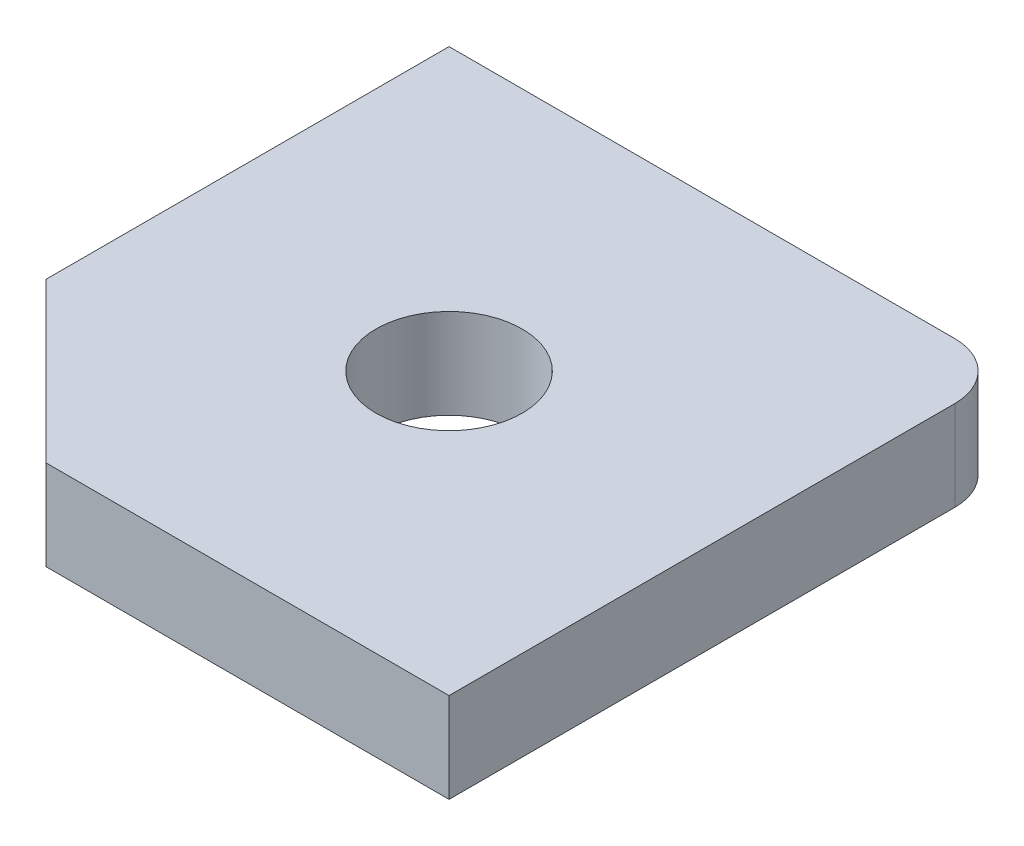
ISO-10303-21;
HEADER;
FILE_DESCRIPTION(('STEP AP214'),'2;1');
FILE_NAME('part.step','',(''),(''),'','','');
FILE_SCHEMA(('AUTOMOTIVE_DESIGN { 1 0 10303 214 1 1 1 1 }'));
ENDSEC;
DATA;
#1=APPLICATION_CONTEXT('core data for automotive mechanical design processes');
#2=APPLICATION_PROTOCOL_DEFINITION('international standard','automotive_design',2000,#1);
#3=PRODUCT_CONTEXT('',#1,'mechanical');
#4=PRODUCT('Part','Part','',(#3));
#5=PRODUCT_RELATED_PRODUCT_CATEGORY('part','',(#4));
#6=PRODUCT_DEFINITION_FORMATION('','',#4);
#7=PRODUCT_DEFINITION_CONTEXT('part definition',#1,'design');
#8=PRODUCT_DEFINITION('design','',#6,#7);
#9=PRODUCT_DEFINITION_SHAPE('','',#8);
#10=(LENGTH_UNIT() NAMED_UNIT(*) SI_UNIT(.MILLI.,.METRE.));
#11=(NAMED_UNIT(*) PLANE_ANGLE_UNIT() SI_UNIT($,.RADIAN.));
#12=(NAMED_UNIT(*) SI_UNIT($,.STERADIAN.) SOLID_ANGLE_UNIT());
#13=UNCERTAINTY_MEASURE_WITH_UNIT(LENGTH_MEASURE(1.E-05),#10,'distance_accuracy_value','');
#14=(GEOMETRIC_REPRESENTATION_CONTEXT(3) GLOBAL_UNCERTAINTY_ASSIGNED_CONTEXT((#13)) GLOBAL_UNIT_ASSIGNED_CONTEXT((#10,
#11,#12)) REPRESENTATION_CONTEXT('',''));
#15=CARTESIAN_POINT('',(0.,0.,0.));
#16=DIRECTION('',(0.,0.,1.));
#17=DIRECTION('',(1.,0.,0.));
#18=AXIS2_PLACEMENT_3D('',#15,#16,#17);
#19=CARTESIAN_POINT('',(-1.38777878078145E-13,-21.9999999999999,-80.0000000000002));
#20=DIRECTION('',(0.,0.,-1.));
#21=DIRECTION('',(0.,-1.,0.));
#22=AXIS2_PLACEMENT_3D('',#19,#20,#21);
#23=PLANE('',#22);
#24=DIRECTION('',(1.,0.,0.));
#25=VECTOR('',#24,1.);
#26=CARTESIAN_POINT('',(-1.38777878078145E-13,-21.9999999999999,-80.0000000000002));
#27=LINE('',#26,#25);
#28=CARTESIAN_POINT('',(550.,-21.9999999999998,-80.0000000000002));
#29=VERTEX_POINT('',#28);
#30=CARTESIAN_POINT('',(595.,-21.9999999999997,-80.0000000000005));
#31=VERTEX_POINT('',#30);
#32=EDGE_CURVE('E98',#29,#31,#27,.T.);
#33=ORIENTED_EDGE('',*,*,#32,.T.);
#34=DIRECTION('',(0.,-1.,0.));
#35=VECTOR('',#34,1.);
#36=CARTESIAN_POINT('',(595.,-30.,-80.0000000000003));
#37=LINE('',#36,#35);
#38=CARTESIAN_POINT('',(595.,-30.,-80.0000000000003));
#39=VERTEX_POINT('',#38);
#40=EDGE_CURVE('E118',#31,#39,#37,.T.);
#41=ORIENTED_EDGE('',*,*,#40,.T.);
#42=DIRECTION('',(1.,0.,0.));
#43=VECTOR('',#42,1.);
#44=CARTESIAN_POINT('',(-1.66533453693773E-13,-29.9999999999998,-80.0000000000001));
#45=LINE('',#44,#43);
#46=CARTESIAN_POINT('',(550.,-29.9999999999998,-80.0000000000004));
#47=VERTEX_POINT('',#46);
#48=EDGE_CURVE('E140',#47,#39,#45,.T.);
#49=ORIENTED_EDGE('',*,*,#48,.F.);
#50=DIRECTION('',(0.,-1.,0.));
#51=VECTOR('',#50,1.);
#52=CARTESIAN_POINT('',(550.,-21.9999999999998,-80.0000000000002));
#53=LINE('',#52,#51);
#54=EDGE_CURVE('E121',#29,#47,#53,.T.);
#55=ORIENTED_EDGE('',*,*,#54,.F.);
#56=EDGE_LOOP('',(#33,#41,#49,#55));
#57=FACE_BOUND('',#56,.T.);
#58=ADVANCED_FACE('F38',(#57),#23,.T.);
#59=CARTESIAN_POINT('',(550.,-21.9999999999995,-620.));
#60=DIRECTION('',(-1.,0.,0.));
#61=DIRECTION('',(0.,1.,0.));
#62=AXIS2_PLACEMENT_3D('',#59,#60,#61);
#63=PLANE('',#62);
#64=DIRECTION('',(0.,0.,-1.));
#65=VECTOR('',#64,1.);
#66=CARTESIAN_POINT('',(550.000000000001,-29.9999999999996,-620.));
#67=LINE('',#66,#65);
#68=CARTESIAN_POINT('',(550.,-29.9999999999996,-44.142135623731));
#69=VERTEX_POINT('',#68);
#70=EDGE_CURVE('E132',#69,#47,#67,.T.);
#71=ORIENTED_EDGE('',*,*,#70,.F.);
#72=DIRECTION('',(0.,-1.,0.));
#73=VECTOR('',#72,1.);
#74=CARTESIAN_POINT('',(550.,-21.9999999999996,-44.1421356237309));
#75=LINE('',#74,#73);
#76=CARTESIAN_POINT('',(550.,-21.9999999999996,-44.1421356237309));
#77=VERTEX_POINT('',#76);
#78=EDGE_CURVE('E113',#77,#69,#75,.T.);
#79=ORIENTED_EDGE('',*,*,#78,.F.);
#80=DIRECTION('',(0.,0.,-1.));
#81=VECTOR('',#80,1.);
#82=CARTESIAN_POINT('',(550.,-21.9999999999995,-620.));
#83=LINE('',#82,#81);
#84=EDGE_CURVE('E111',#77,#29,#83,.T.);
#85=ORIENTED_EDGE('',*,*,#84,.T.);
#86=ORIENTED_EDGE('',*,*,#54,.T.);
#87=EDGE_LOOP('',(#71,#79,#85,#86));
#88=FACE_BOUND('',#87,.T.);
#89=ADVANCED_FACE('F164',(#88),#63,.T.);
#90=CARTESIAN_POINT('',(-12.9289321881345,-21.9999999999996,-607.071067811865));
#91=DIRECTION('',(-0.707106781186548,0.,0.707106781186548));
#92=DIRECTION('',(0.707106781186547,0.,0.707106781186547));
#93=AXIS2_PLACEMENT_3D('',#90,#91,#92);
#94=PLANE('',#93);
#95=DIRECTION('',(-0.707106781186547,0.,-0.707106781186548));
#96=VECTOR('',#95,1.);
#97=CARTESIAN_POINT('',(-12.9289321881343,-29.9999999999998,-607.071067811866));
#98=LINE('',#97,#96);
#99=CARTESIAN_POINT('',(564.142135623731,-29.9999999999998,-30.0000000000001));
#100=VERTEX_POINT('',#99);
#101=EDGE_CURVE('E135',#100,#69,#98,.T.);
#102=ORIENTED_EDGE('',*,*,#101,.F.);
#103=DIRECTION('',(0.,-1.,0.));
#104=VECTOR('',#103,1.);
#105=CARTESIAN_POINT('',(564.142135623731,-21.9999999999996,-30.0000000000002));
#106=LINE('',#105,#104);
#107=CARTESIAN_POINT('',(564.142135623731,-21.9999999999996,-30.0000000000002));
#108=VERTEX_POINT('',#107);
#109=EDGE_CURVE('E110',#108,#100,#106,.T.);
#110=ORIENTED_EDGE('',*,*,#109,.F.);
#111=DIRECTION('',(-0.707106781186547,0.,-0.707106781186548));
#112=VECTOR('',#111,1.);
#113=CARTESIAN_POINT('',(-12.9289321881345,-21.9999999999996,-607.071067811865));
#114=LINE('',#113,#112);
#115=EDGE_CURVE('E103',#108,#77,#114,.T.);
#116=ORIENTED_EDGE('',*,*,#115,.T.);
#117=ORIENTED_EDGE('',*,*,#78,.T.);
#118=EDGE_LOOP('',(#102,#110,#116,#117));
#119=FACE_BOUND('',#118,.T.);
#120=ADVANCED_FACE('F163',(#119),#94,.T.);
#121=CARTESIAN_POINT('',(0.,-21.9999999999998,-30.0000000000001));
#122=DIRECTION('',(0.,0.,-1.));
#123=DIRECTION('',(0.,-1.,0.));
#124=AXIS2_PLACEMENT_3D('',#121,#122,#123);
#125=PLANE('',#124);
#126=DIRECTION('',(1.,0.,0.));
#127=VECTOR('',#126,1.);
#128=CARTESIAN_POINT('',(0.,-29.9999999999999,-29.9999999999999));
#129=LINE('',#128,#127);
#130=CARTESIAN_POINT('',(600.,-29.9999999999997,-30.0000000000002));
#131=VERTEX_POINT('',#130);
#132=EDGE_CURVE('E109',#100,#131,#129,.T.);
#133=ORIENTED_EDGE('',*,*,#132,.T.);
#134=DIRECTION('',(0.,-1.,0.));
#135=VECTOR('',#134,1.);
#136=CARTESIAN_POINT('',(600.,-21.9999999999995,-30.0000000000001));
#137=LINE('',#136,#135);
#138=CARTESIAN_POINT('',(600.,-21.9999999999995,-30.0000000000001));
#139=VERTEX_POINT('',#138);
#140=EDGE_CURVE('E94',#139,#131,#137,.T.);
#141=ORIENTED_EDGE('',*,*,#140,.F.);
#142=DIRECTION('',(1.,0.,0.));
#143=VECTOR('',#142,1.);
#144=CARTESIAN_POINT('',(0.,-21.9999999999998,-30.0000000000001));
#145=LINE('',#144,#143);
#146=EDGE_CURVE('E97',#108,#139,#145,.T.);
#147=ORIENTED_EDGE('',*,*,#146,.F.);
#148=ORIENTED_EDGE('',*,*,#109,.T.);
#149=EDGE_LOOP('',(#133,#141,#147,#148));
#150=FACE_BOUND('',#149,.T.);
#151=ADVANCED_FACE('F108',(#150),#125,.F.);
#152=CARTESIAN_POINT('',(575.,-21.9999999999997,-55.0000000000004));
#153=DIRECTION('',(0.,-1.,0.));
#154=DIRECTION('',(0.,0.,1.));
#155=AXIS2_PLACEMENT_3D('',#152,#153,#154);
#156=CYLINDRICAL_SURFACE('',#155,6.49999999999991);
#157=CARTESIAN_POINT('',(575.,-21.9999999999997,-55.0000000000004));
#158=DIRECTION('',(0.,-1.,0.));
#159=DIRECTION('',(0.,0.,1.));
#160=AXIS2_PLACEMENT_3D('',#157,#158,#159);
#161=CIRCLE('',#160,6.49999999999991);
#162=CARTESIAN_POINT('',(575.,-21.9999999999997,-48.5000000000004));
#163=VERTEX_POINT('',#162);
#164=EDGE_CURVE('E134',#163,#163,#161,.T.);
#165=ORIENTED_EDGE('',*,*,#164,.F.);
#166=EDGE_LOOP('',(#165));
#167=FACE_BOUND('',#166,.T.);
#168=CARTESIAN_POINT('',(575.,-29.9999999999999,-55.0000000000003));
#169=DIRECTION('',(0.,-1.,0.));
#170=DIRECTION('',(0.,0.,1.));
#171=AXIS2_PLACEMENT_3D('',#168,#169,#170);
#172=CIRCLE('',#171,6.49999999999991);
#173=CARTESIAN_POINT('',(575.,-29.9999999999999,-48.5000000000004));
#174=VERTEX_POINT('',#173);
#175=EDGE_CURVE('E142',#174,#174,#172,.T.);
#176=ORIENTED_EDGE('',*,*,#175,.T.);
#177=EDGE_LOOP('',(#176));
#178=FACE_BOUND('',#177,.T.);
#179=ADVANCED_FACE('F151',(#167,#178),#156,.F.);
#180=CARTESIAN_POINT('',(600.,-21.9999999999997,-620.));
#181=DIRECTION('',(-1.,0.,0.));
#182=DIRECTION('',(0.,1.,0.));
#183=AXIS2_PLACEMENT_3D('',#180,#181,#182);
#184=PLANE('',#183);
#185=DIRECTION('',(0.,0.,-1.));
#186=VECTOR('',#185,1.);
#187=CARTESIAN_POINT('',(600.,-29.9999999999997,-620.));
#188=LINE('',#187,#186);
#189=CARTESIAN_POINT('',(600.,-29.9999999999998,-75.0000000000003));
#190=VERTEX_POINT('',#189);
#191=EDGE_CURVE('E138',#131,#190,#188,.T.);
#192=ORIENTED_EDGE('',*,*,#191,.T.);
#193=DIRECTION('',(0.,-1.,0.));
#194=VECTOR('',#193,1.);
#195=CARTESIAN_POINT('',(600.,-21.9999999999996,-74.9999999999999));
#196=LINE('',#195,#194);
#197=CARTESIAN_POINT('',(600.,-21.9999999999996,-74.9999999999999));
#198=VERTEX_POINT('',#197);
#199=EDGE_CURVE('E46',#190,#198,#196,.F.);
#200=ORIENTED_EDGE('',*,*,#199,.T.);
#201=DIRECTION('',(0.,0.,-1.));
#202=VECTOR('',#201,1.);
#203=CARTESIAN_POINT('',(600.,-21.9999999999997,-620.));
#204=LINE('',#203,#202);
#205=EDGE_CURVE('E89',#139,#198,#204,.T.);
#206=ORIENTED_EDGE('',*,*,#205,.F.);
#207=ORIENTED_EDGE('',*,*,#140,.T.);
#208=EDGE_LOOP('',(#192,#200,#206,#207));
#209=FACE_BOUND('',#208,.T.);
#210=ADVANCED_FACE('F92',(#209),#184,.F.);
#211=CARTESIAN_POINT('',(2.4980018054066E-13,-21.9999999999997,-620.));
#212=DIRECTION('',(0.,-1.,0.));
#213=DIRECTION('',(0.,0.,1.));
#214=AXIS2_PLACEMENT_3D('',#211,#212,#213);
#215=PLANE('',#214);
#216=ORIENTED_EDGE('',*,*,#164,.T.);
#217=EDGE_LOOP('',(#216));
#218=FACE_BOUND('',#217,.T.);
#219=ORIENTED_EDGE('',*,*,#205,.T.);
#220=CARTESIAN_POINT('',(595.,-21.9999999999998,-75.));
#221=DIRECTION('',(0.,-1.,0.));
#222=DIRECTION('',(0.,0.,1.));
#223=AXIS2_PLACEMENT_3D('',#220,#221,#222);
#224=CIRCLE('',#223,5.);
#225=EDGE_CURVE('E11',#198,#31,#224,.F.);
#226=ORIENTED_EDGE('',*,*,#225,.T.);
#227=ORIENTED_EDGE('',*,*,#32,.F.);
#228=ORIENTED_EDGE('',*,*,#84,.F.);
#229=ORIENTED_EDGE('',*,*,#115,.F.);
#230=ORIENTED_EDGE('',*,*,#146,.T.);
#231=EDGE_LOOP('',(#219,#226,#227,#228,#229,#230));
#232=FACE_BOUND('',#231,.T.);
#233=ADVANCED_FACE('F101',(#218,#232),#215,.F.);
#234=CARTESIAN_POINT('',(1.38777878078145E-13,-29.9999999999997,-620.));
#235=DIRECTION('',(0.,-1.,0.));
#236=DIRECTION('',(0.,0.,1.));
#237=AXIS2_PLACEMENT_3D('',#234,#235,#236);
#238=PLANE('',#237);
#239=ORIENTED_EDGE('',*,*,#175,.F.);
#240=EDGE_LOOP('',(#239));
#241=FACE_BOUND('',#240,.T.);
#242=ORIENTED_EDGE('',*,*,#48,.T.);
#243=CARTESIAN_POINT('',(595.,-29.9999999999996,-75.0000000000004));
#244=DIRECTION('',(0.,-1.,0.));
#245=DIRECTION('',(0.,0.,1.));
#246=AXIS2_PLACEMENT_3D('',#243,#244,#245);
#247=CIRCLE('',#246,5.);
#248=EDGE_CURVE('E59',#39,#190,#247,.T.);
#249=ORIENTED_EDGE('',*,*,#248,.T.);
#250=ORIENTED_EDGE('',*,*,#191,.F.);
#251=ORIENTED_EDGE('',*,*,#132,.F.);
#252=ORIENTED_EDGE('',*,*,#101,.T.);
#253=ORIENTED_EDGE('',*,*,#70,.T.);
#254=EDGE_LOOP('',(#242,#249,#250,#251,#252,#253));
#255=FACE_BOUND('',#254,.T.);
#256=ADVANCED_FACE('F156',(#241,#255),#238,.T.);
#257=CARTESIAN_POINT('',(595.,-21.9999999999998,-75.));
#258=DIRECTION('',(0.,1.,0.));
#259=DIRECTION('',(0.,0.,-1.));
#260=AXIS2_PLACEMENT_3D('',#257,#258,#259);
#261=CYLINDRICAL_SURFACE('',#260,5.);
#262=ORIENTED_EDGE('',*,*,#225,.F.);
#263=ORIENTED_EDGE('',*,*,#199,.F.);
#264=ORIENTED_EDGE('',*,*,#248,.F.);
#265=ORIENTED_EDGE('',*,*,#40,.F.);
#266=EDGE_LOOP('',(#262,#263,#264,#265));
#267=FACE_BOUND('',#266,.T.);
#268=ADVANCED_FACE('F40',(#267),#261,.T.);
#269=CLOSED_SHELL('',(#58,#89,#120,#151,#179,#210,#233,#256,#268));
#270=MANIFOLD_SOLID_BREP('B2',#269);
#271=ADVANCED_BREP_SHAPE_REPRESENTATION('',(#18,#270),#14);
#272=SHAPE_DEFINITION_REPRESENTATION(#9,#271);
ENDSEC;
END-ISO-10303-21;
